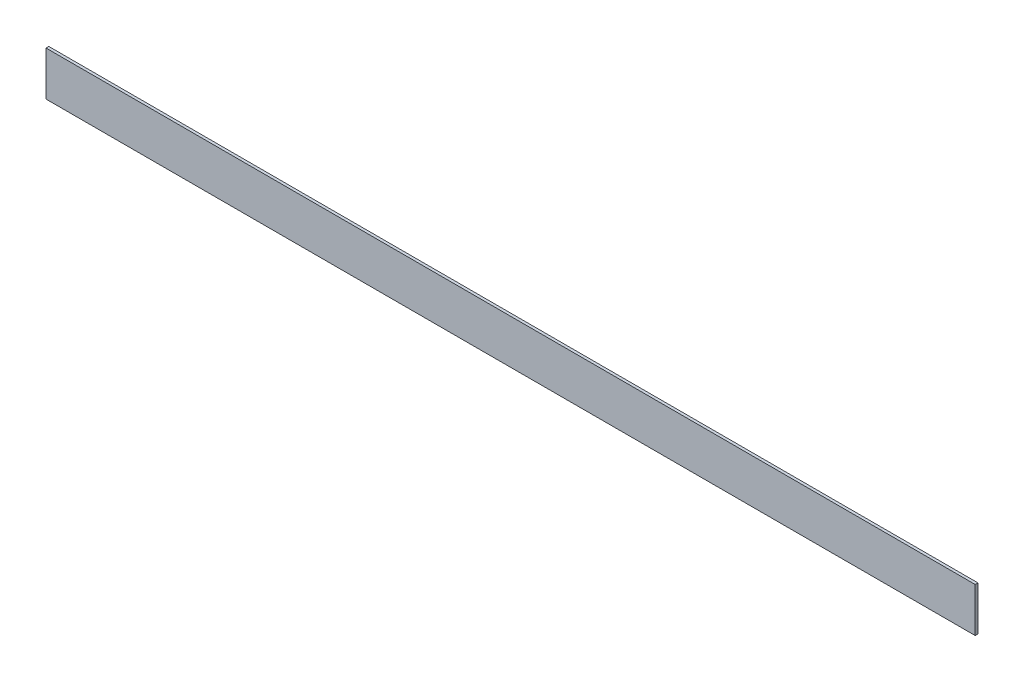
ISO-10303-21;
HEADER;
FILE_DESCRIPTION(('STEP AP214'),'2;1');
FILE_NAME('part.step','',(''),(''),'','','');
FILE_SCHEMA(('AUTOMOTIVE_DESIGN { 1 0 10303 214 1 1 1 1 }'));
ENDSEC;
DATA;
#1=APPLICATION_CONTEXT('core data for automotive mechanical design processes');
#2=APPLICATION_PROTOCOL_DEFINITION('international standard','automotive_design',2000,#1);
#3=PRODUCT_CONTEXT('',#1,'mechanical');
#4=PRODUCT('Part','Part','',(#3));
#5=PRODUCT_RELATED_PRODUCT_CATEGORY('part','',(#4));
#6=PRODUCT_DEFINITION_FORMATION('','',#4);
#7=PRODUCT_DEFINITION_CONTEXT('part definition',#1,'design');
#8=PRODUCT_DEFINITION('design','',#6,#7);
#9=PRODUCT_DEFINITION_SHAPE('','',#8);
#10=(LENGTH_UNIT() NAMED_UNIT(*) SI_UNIT(.MILLI.,.METRE.));
#11=(NAMED_UNIT(*) PLANE_ANGLE_UNIT() SI_UNIT($,.RADIAN.));
#12=(NAMED_UNIT(*) SI_UNIT($,.STERADIAN.) SOLID_ANGLE_UNIT());
#13=UNCERTAINTY_MEASURE_WITH_UNIT(LENGTH_MEASURE(1.E-05),#10,'distance_accuracy_value','');
#14=(GEOMETRIC_REPRESENTATION_CONTEXT(3) GLOBAL_UNCERTAINTY_ASSIGNED_CONTEXT((#13)) GLOBAL_UNIT_ASSIGNED_CONTEXT((#10,
#11,#12)) REPRESENTATION_CONTEXT('',''));
#15=CARTESIAN_POINT('',(0.,0.,0.));
#16=DIRECTION('',(0.,0.,1.));
#17=DIRECTION('',(1.,0.,0.));
#18=AXIS2_PLACEMENT_3D('',#15,#16,#17);
#19=CARTESIAN_POINT('',(-128.863977270982,114.28743287661,1.5875));
#20=DIRECTION('',(1.,0.,0.));
#21=DIRECTION('',(0.,0.,-1.));
#22=AXIS2_PLACEMENT_3D('',#19,#20,#21);
#23=PLANE('',#22);
#24=DIRECTION('',(0.,-1.,0.));
#25=VECTOR('',#24,1.);
#26=CARTESIAN_POINT('',(-128.863977270982,114.28743287661,0.));
#27=LINE('',#26,#25);
#28=CARTESIAN_POINT('',(-128.863977270982,114.28743287661,0.));
#29=VERTEX_POINT('',#28);
#30=CARTESIAN_POINT('',(-128.863977270982,88.8874328766103,0.));
#31=VERTEX_POINT('',#30);
#32=EDGE_CURVE('E95',#29,#31,#27,.T.);
#33=ORIENTED_EDGE('',*,*,#32,.T.);
#34=DIRECTION('',(0.,0.,-1.));
#35=VECTOR('',#34,1.);
#36=CARTESIAN_POINT('',(-128.863977270982,88.8874328766103,1.5875));
#37=LINE('',#36,#35);
#38=CARTESIAN_POINT('',(-128.863977270982,88.8874328766103,1.5875));
#39=VERTEX_POINT('',#38);
#40=EDGE_CURVE('E11',#39,#31,#37,.T.);
#41=ORIENTED_EDGE('',*,*,#40,.F.);
#42=DIRECTION('',(0.,-1.,0.));
#43=VECTOR('',#42,1.);
#44=CARTESIAN_POINT('',(-128.863977270982,114.28743287661,1.5875));
#45=LINE('',#44,#43);
#46=CARTESIAN_POINT('',(-128.863977270982,114.28743287661,1.5875));
#47=VERTEX_POINT('',#46);
#48=EDGE_CURVE('E83',#47,#39,#45,.T.);
#49=ORIENTED_EDGE('',*,*,#48,.F.);
#50=DIRECTION('',(0.,0.,-1.));
#51=VECTOR('',#50,1.);
#52=CARTESIAN_POINT('',(-128.863977270982,114.28743287661,1.5875));
#53=LINE('',#52,#51);
#54=EDGE_CURVE('E91',#47,#29,#53,.T.);
#55=ORIENTED_EDGE('',*,*,#54,.T.);
#56=EDGE_LOOP('',(#33,#41,#49,#55));
#57=FACE_BOUND('',#56,.T.);
#58=ADVANCED_FACE('F32',(#57),#23,.F.);
#59=CARTESIAN_POINT('',(-128.863977270982,88.8874328766103,1.5875));
#60=DIRECTION('',(0.,1.,0.));
#61=DIRECTION('',(-1.,0.,0.));
#62=AXIS2_PLACEMENT_3D('',#59,#60,#61);
#63=PLANE('',#62);
#64=DIRECTION('',(1.,0.,0.));
#65=VECTOR('',#64,1.);
#66=CARTESIAN_POINT('',(-128.863977270982,88.8874328766103,0.));
#67=LINE('',#66,#65);
#68=CARTESIAN_POINT('',(404.536022729018,88.8874328766103,0.));
#69=VERTEX_POINT('',#68);
#70=EDGE_CURVE('E87',#31,#69,#67,.T.);
#71=ORIENTED_EDGE('',*,*,#70,.T.);
#72=DIRECTION('',(0.,0.,-1.));
#73=VECTOR('',#72,1.);
#74=CARTESIAN_POINT('',(404.536022729018,88.8874328766103,1.5875));
#75=LINE('',#74,#73);
#76=CARTESIAN_POINT('',(404.536022729018,88.8874328766103,1.5875));
#77=VERTEX_POINT('',#76);
#78=EDGE_CURVE('E40',#77,#69,#75,.T.);
#79=ORIENTED_EDGE('',*,*,#78,.F.);
#80=DIRECTION('',(1.,0.,0.));
#81=VECTOR('',#80,1.);
#82=CARTESIAN_POINT('',(-128.863977270982,88.8874328766103,1.5875));
#83=LINE('',#82,#81);
#84=EDGE_CURVE('E78',#39,#77,#83,.T.);
#85=ORIENTED_EDGE('',*,*,#84,.F.);
#86=ORIENTED_EDGE('',*,*,#40,.T.);
#87=EDGE_LOOP('',(#71,#79,#85,#86));
#88=FACE_BOUND('',#87,.T.);
#89=ADVANCED_FACE('F86',(#88),#63,.F.);
#90=CARTESIAN_POINT('',(404.536022729018,114.28743287661,1.5875));
#91=DIRECTION('',(-1.,0.,0.));
#92=DIRECTION('',(0.,-1.,0.));
#93=AXIS2_PLACEMENT_3D('',#90,#91,#92);
#94=PLANE('',#93);
#95=DIRECTION('',(0.,1.,0.));
#96=VECTOR('',#95,1.);
#97=CARTESIAN_POINT('',(404.536022729018,114.28743287661,0.));
#98=LINE('',#97,#96);
#99=CARTESIAN_POINT('',(404.536022729018,114.28743287661,0.));
#100=VERTEX_POINT('',#99);
#101=EDGE_CURVE('E65',#69,#100,#98,.T.);
#102=ORIENTED_EDGE('',*,*,#101,.T.);
#103=DIRECTION('',(0.,0.,-1.));
#104=VECTOR('',#103,1.);
#105=CARTESIAN_POINT('',(404.536022729018,114.28743287661,1.5875));
#106=LINE('',#105,#104);
#107=CARTESIAN_POINT('',(404.536022729018,114.28743287661,1.5875));
#108=VERTEX_POINT('',#107);
#109=EDGE_CURVE('E88',#108,#100,#106,.T.);
#110=ORIENTED_EDGE('',*,*,#109,.F.);
#111=DIRECTION('',(0.,1.,0.));
#112=VECTOR('',#111,1.);
#113=CARTESIAN_POINT('',(404.536022729018,114.28743287661,1.5875));
#114=LINE('',#113,#112);
#115=EDGE_CURVE('E81',#77,#108,#114,.T.);
#116=ORIENTED_EDGE('',*,*,#115,.F.);
#117=ORIENTED_EDGE('',*,*,#78,.T.);
#118=EDGE_LOOP('',(#102,#110,#116,#117));
#119=FACE_BOUND('',#118,.T.);
#120=ADVANCED_FACE('F89',(#119),#94,.F.);
#121=CARTESIAN_POINT('',(-128.863977270982,114.28743287661,1.5875));
#122=DIRECTION('',(0.,-1.,0.));
#123=DIRECTION('',(0.,0.,-1.));
#124=AXIS2_PLACEMENT_3D('',#121,#122,#123);
#125=PLANE('',#124);
#126=DIRECTION('',(-1.,0.,0.));
#127=VECTOR('',#126,1.);
#128=CARTESIAN_POINT('',(-128.863977270982,114.28743287661,0.));
#129=LINE('',#128,#127);
#130=EDGE_CURVE('E71',#100,#29,#129,.T.);
#131=ORIENTED_EDGE('',*,*,#130,.T.);
#132=ORIENTED_EDGE('',*,*,#54,.F.);
#133=DIRECTION('',(-1.,0.,0.));
#134=VECTOR('',#133,1.);
#135=CARTESIAN_POINT('',(-128.863977270982,114.28743287661,1.5875));
#136=LINE('',#135,#134);
#137=EDGE_CURVE('E48',#108,#47,#136,.T.);
#138=ORIENTED_EDGE('',*,*,#137,.F.);
#139=ORIENTED_EDGE('',*,*,#109,.T.);
#140=EDGE_LOOP('',(#131,#132,#138,#139));
#141=FACE_BOUND('',#140,.T.);
#142=ADVANCED_FACE('F102',(#141),#125,.F.);
#143=CARTESIAN_POINT('',(0.,0.,1.5875));
#144=DIRECTION('',(0.,0.,1.));
#145=DIRECTION('',(1.,0.,0.));
#146=AXIS2_PLACEMENT_3D('',#143,#144,#145);
#147=PLANE('',#146);
#148=ORIENTED_EDGE('',*,*,#48,.T.);
#149=ORIENTED_EDGE('',*,*,#84,.T.);
#150=ORIENTED_EDGE('',*,*,#115,.T.);
#151=ORIENTED_EDGE('',*,*,#137,.T.);
#152=EDGE_LOOP('',(#148,#149,#150,#151));
#153=FACE_BOUND('',#152,.T.);
#154=ADVANCED_FACE('F79',(#153),#147,.T.);
#155=CARTESIAN_POINT('',(0.,0.,0.));
#156=DIRECTION('',(0.,0.,1.));
#157=DIRECTION('',(1.,0.,0.));
#158=AXIS2_PLACEMENT_3D('',#155,#156,#157);
#159=PLANE('',#158);
#160=ORIENTED_EDGE('',*,*,#32,.F.);
#161=ORIENTED_EDGE('',*,*,#130,.F.);
#162=ORIENTED_EDGE('',*,*,#101,.F.);
#163=ORIENTED_EDGE('',*,*,#70,.F.);
#164=EDGE_LOOP('',(#160,#161,#162,#163));
#165=FACE_BOUND('',#164,.T.);
#166=ADVANCED_FACE('F105',(#165),#159,.F.);
#167=CLOSED_SHELL('',(#58,#89,#120,#142,#154,#166));
#168=MANIFOLD_SOLID_BREP('B2',#167);
#169=ADVANCED_BREP_SHAPE_REPRESENTATION('',(#18,#168),#14);
#170=SHAPE_DEFINITION_REPRESENTATION(#9,#169);
ENDSEC;
END-ISO-10303-21;
